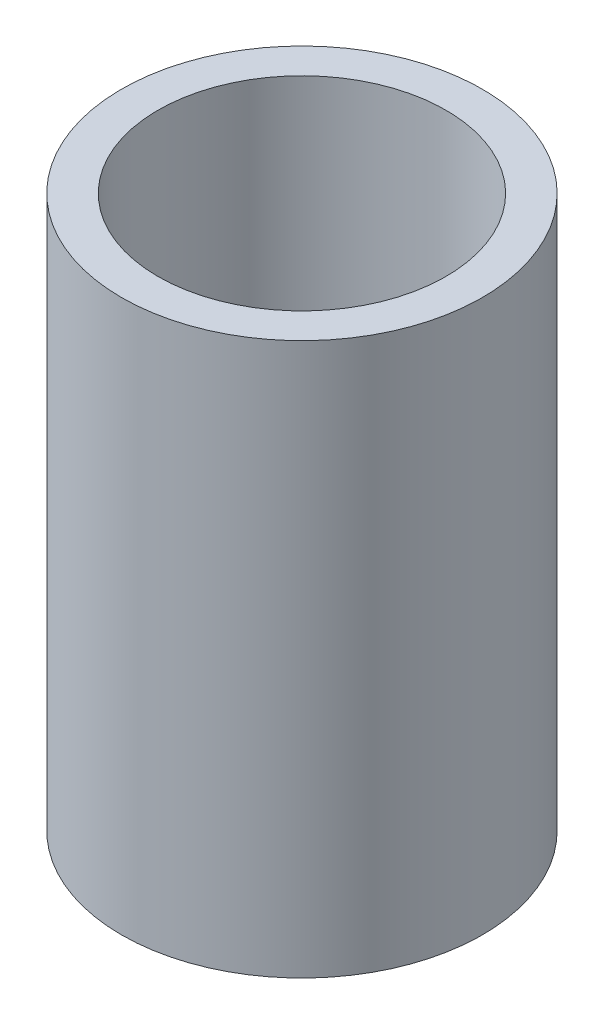
ISO-10303-21;
HEADER;
FILE_DESCRIPTION(('STEP AP214'),'2;1');
FILE_NAME('part.step','',(''),(''),'','','');
FILE_SCHEMA(('AUTOMOTIVE_DESIGN { 1 0 10303 214 1 1 1 1 }'));
ENDSEC;
DATA;
#1=APPLICATION_CONTEXT('core data for automotive mechanical design processes');
#2=APPLICATION_PROTOCOL_DEFINITION('international standard','automotive_design',2000,#1);
#3=PRODUCT_CONTEXT('',#1,'mechanical');
#4=PRODUCT('Part','Part','',(#3));
#5=PRODUCT_RELATED_PRODUCT_CATEGORY('part','',(#4));
#6=PRODUCT_DEFINITION_FORMATION('','',#4);
#7=PRODUCT_DEFINITION_CONTEXT('part definition',#1,'design');
#8=PRODUCT_DEFINITION('design','',#6,#7);
#9=PRODUCT_DEFINITION_SHAPE('','',#8);
#10=(LENGTH_UNIT() NAMED_UNIT(*) SI_UNIT(.MILLI.,.METRE.));
#11=(NAMED_UNIT(*) PLANE_ANGLE_UNIT() SI_UNIT($,.RADIAN.));
#12=(NAMED_UNIT(*) SI_UNIT($,.STERADIAN.) SOLID_ANGLE_UNIT());
#13=UNCERTAINTY_MEASURE_WITH_UNIT(LENGTH_MEASURE(1.E-05),#10,'distance_accuracy_value','');
#14=(GEOMETRIC_REPRESENTATION_CONTEXT(3) GLOBAL_UNCERTAINTY_ASSIGNED_CONTEXT((#13)) GLOBAL_UNIT_ASSIGNED_CONTEXT((#10,
#11,#12)) REPRESENTATION_CONTEXT('',''));
#15=CARTESIAN_POINT('',(0.,0.,0.));
#16=DIRECTION('',(0.,0.,1.));
#17=DIRECTION('',(1.,0.,0.));
#18=AXIS2_PLACEMENT_3D('',#15,#16,#17);
#19=CARTESIAN_POINT('',(0.,20.6375,0.));
#20=DIRECTION('',(0.,-1.,0.));
#21=DIRECTION('',(0.,0.,-1.));
#22=AXIS2_PLACEMENT_3D('',#19,#20,#21);
#23=CYLINDRICAL_SURFACE('',#22,10.7696);
#24=CARTESIAN_POINT('',(0.,-20.6375,0.));
#25=DIRECTION('',(0.,1.,0.));
#26=DIRECTION('',(0.,0.,1.));
#27=AXIS2_PLACEMENT_3D('',#24,#25,#26);
#28=CIRCLE('',#27,10.7696);
#29=CARTESIAN_POINT('',(0.,-20.6375,10.7696));
#30=VERTEX_POINT('',#29);
#31=EDGE_CURVE('E51',#30,#30,#28,.T.);
#32=ORIENTED_EDGE('',*,*,#31,.F.);
#33=EDGE_LOOP('',(#32));
#34=FACE_BOUND('',#33,.T.);
#35=CARTESIAN_POINT('',(0.,-0.79375,0.));
#36=DIRECTION('',(0.,1.,0.));
#37=DIRECTION('',(0.,0.,1.));
#38=AXIS2_PLACEMENT_3D('',#35,#36,#37);
#39=CIRCLE('',#38,10.7696);
#40=CARTESIAN_POINT('',(0.,-0.79375,10.7696));
#41=VERTEX_POINT('',#40);
#42=EDGE_CURVE('E54',#41,#41,#39,.T.);
#43=ORIENTED_EDGE('',*,*,#42,.T.);
#44=EDGE_LOOP('',(#43));
#45=FACE_BOUND('',#44,.T.);
#46=ADVANCED_FACE('F33',(#34,#45),#23,.F.);
#47=CARTESIAN_POINT('',(0.,20.6375,0.));
#48=DIRECTION('',(0.,1.,0.));
#49=DIRECTION('',(0.,0.,1.));
#50=AXIS2_PLACEMENT_3D('',#47,#48,#49);
#51=PLANE('',#50);
#52=CARTESIAN_POINT('',(0.,20.6375,0.));
#53=DIRECTION('',(0.,1.,0.));
#54=DIRECTION('',(0.,0.,1.));
#55=AXIS2_PLACEMENT_3D('',#52,#53,#54);
#56=CIRCLE('',#55,13.49375);
#57=CARTESIAN_POINT('',(0.,20.6375,13.49375));
#58=VERTEX_POINT('',#57);
#59=EDGE_CURVE('E40',#58,#58,#56,.T.);
#60=ORIENTED_EDGE('',*,*,#59,.T.);
#61=EDGE_LOOP('',(#60));
#62=FACE_BOUND('',#61,.T.);
#63=CARTESIAN_POINT('',(0.,20.6375,0.));
#64=DIRECTION('',(0.,1.,0.));
#65=DIRECTION('',(0.,0.,1.));
#66=AXIS2_PLACEMENT_3D('',#63,#64,#65);
#67=CIRCLE('',#66,10.7696);
#68=CARTESIAN_POINT('',(0.,20.6375,10.7696));
#69=VERTEX_POINT('',#68);
#70=EDGE_CURVE('E49',#69,#69,#67,.T.);
#71=ORIENTED_EDGE('',*,*,#70,.F.);
#72=EDGE_LOOP('',(#71));
#73=FACE_BOUND('',#72,.T.);
#74=ADVANCED_FACE('F84',(#62,#73),#51,.T.);
#75=CARTESIAN_POINT('',(0.,-20.6375,0.));
#76=DIRECTION('',(0.,1.,0.));
#77=DIRECTION('',(0.,0.,1.));
#78=AXIS2_PLACEMENT_3D('',#75,#76,#77);
#79=PLANE('',#78);
#80=CARTESIAN_POINT('',(0.,-20.6375,0.));
#81=DIRECTION('',(0.,1.,0.));
#82=DIRECTION('',(0.,0.,1.));
#83=AXIS2_PLACEMENT_3D('',#80,#81,#82);
#84=CIRCLE('',#83,13.49375);
#85=CARTESIAN_POINT('',(0.,-20.6375,13.49375));
#86=VERTEX_POINT('',#85);
#87=EDGE_CURVE('E44',#86,#86,#84,.T.);
#88=ORIENTED_EDGE('',*,*,#87,.F.);
#89=EDGE_LOOP('',(#88));
#90=FACE_BOUND('',#89,.T.);
#91=ORIENTED_EDGE('',*,*,#31,.T.);
#92=EDGE_LOOP('',(#91));
#93=FACE_BOUND('',#92,.T.);
#94=ADVANCED_FACE('F89',(#90,#93),#79,.F.);
#95=CARTESIAN_POINT('',(0.,20.6375,0.));
#96=DIRECTION('',(0.,-1.,0.));
#97=DIRECTION('',(0.,0.,-1.));
#98=AXIS2_PLACEMENT_3D('',#95,#96,#97);
#99=CYLINDRICAL_SURFACE('',#98,13.49375);
#100=ORIENTED_EDGE('',*,*,#59,.F.);
#101=EDGE_LOOP('',(#100));
#102=FACE_BOUND('',#101,.T.);
#103=ORIENTED_EDGE('',*,*,#87,.T.);
#104=EDGE_LOOP('',(#103));
#105=FACE_BOUND('',#104,.T.);
#106=ADVANCED_FACE('F35',(#102,#105),#99,.T.);
#107=CARTESIAN_POINT('',(0.,0.793749999999999,0.));
#108=DIRECTION('',(0.,1.,0.));
#109=DIRECTION('',(0.,0.,1.));
#110=AXIS2_PLACEMENT_3D('',#107,#108,#109);
#111=CIRCLE('',#110,10.7696);
#112=CARTESIAN_POINT('',(0.,0.793749999999999,10.7696));
#113=VERTEX_POINT('',#112);
#114=EDGE_CURVE('E10',#113,#113,#111,.T.);
#115=ORIENTED_EDGE('',*,*,#114,.F.);
#116=EDGE_LOOP('',(#115));
#117=FACE_BOUND('',#116,.T.);
#118=ORIENTED_EDGE('',*,*,#70,.T.);
#119=EDGE_LOOP('',(#118));
#120=FACE_BOUND('',#119,.T.);
#121=ADVANCED_FACE('F72',(#117,#120),#23,.F.);
#122=CARTESIAN_POINT('',(0.,0.79375,0.));
#123=DIRECTION('',(0.,1.,0.));
#124=DIRECTION('',(0.,0.,1.));
#125=AXIS2_PLACEMENT_3D('',#122,#123,#124);
#126=PLANE('',#125);
#127=ORIENTED_EDGE('',*,*,#114,.T.);
#128=EDGE_LOOP('',(#127));
#129=FACE_BOUND('',#128,.T.);
#130=CARTESIAN_POINT('',(0.,0.79375,0.));
#131=DIRECTION('',(0.,1.,0.));
#132=DIRECTION('',(0.,0.,1.));
#133=AXIS2_PLACEMENT_3D('',#130,#131,#132);
#134=CIRCLE('',#133,8.001);
#135=CARTESIAN_POINT('',(0.,0.79375,8.001));
#136=VERTEX_POINT('',#135);
#137=EDGE_CURVE('E59',#136,#136,#134,.T.);
#138=ORIENTED_EDGE('',*,*,#137,.F.);
#139=EDGE_LOOP('',(#138));
#140=FACE_BOUND('',#139,.T.);
#141=ADVANCED_FACE('F69',(#129,#140),#126,.T.);
#142=CARTESIAN_POINT('',(0.,-0.79375,0.));
#143=DIRECTION('',(0.,1.,0.));
#144=DIRECTION('',(0.,0.,1.));
#145=AXIS2_PLACEMENT_3D('',#142,#143,#144);
#146=PLANE('',#145);
#147=ORIENTED_EDGE('',*,*,#42,.F.);
#148=EDGE_LOOP('',(#147));
#149=FACE_BOUND('',#148,.T.);
#150=CARTESIAN_POINT('',(0.,-0.79375,0.));
#151=DIRECTION('',(0.,1.,0.));
#152=DIRECTION('',(0.,0.,1.));
#153=AXIS2_PLACEMENT_3D('',#150,#151,#152);
#154=CIRCLE('',#153,8.001);
#155=CARTESIAN_POINT('',(0.,-0.79375,8.001));
#156=VERTEX_POINT('',#155);
#157=EDGE_CURVE('E60',#156,#156,#154,.T.);
#158=ORIENTED_EDGE('',*,*,#157,.T.);
#159=EDGE_LOOP('',(#158));
#160=FACE_BOUND('',#159,.T.);
#161=ADVANCED_FACE('F71',(#149,#160),#146,.F.);
#162=CARTESIAN_POINT('',(0.,0.79375,0.));
#163=DIRECTION('',(0.,-1.,0.));
#164=DIRECTION('',(0.,0.,-1.));
#165=AXIS2_PLACEMENT_3D('',#162,#163,#164);
#166=CYLINDRICAL_SURFACE('',#165,8.001);
#167=ORIENTED_EDGE('',*,*,#137,.T.);
#168=EDGE_LOOP('',(#167));
#169=FACE_BOUND('',#168,.T.);
#170=ORIENTED_EDGE('',*,*,#157,.F.);
#171=EDGE_LOOP('',(#170));
#172=FACE_BOUND('',#171,.T.);
#173=ADVANCED_FACE('F66',(#169,#172),#166,.F.);
#174=CLOSED_SHELL('',(#46,#74,#94,#106,#121,#141,#161,#173));
#175=MANIFOLD_SOLID_BREP('B2',#174);
#176=ADVANCED_BREP_SHAPE_REPRESENTATION('',(#18,#175),#14);
#177=SHAPE_DEFINITION_REPRESENTATION(#9,#176);
ENDSEC;
END-ISO-10303-21;
